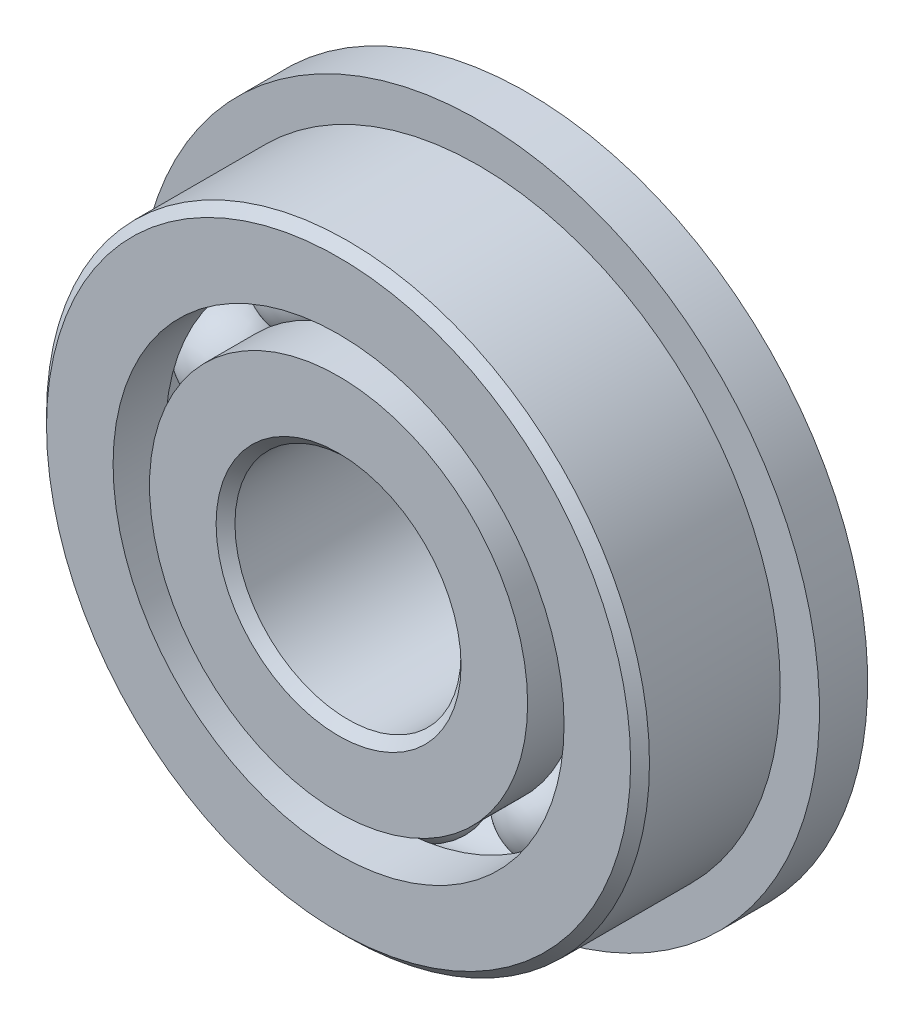
ISO-10303-21;
HEADER;
FILE_DESCRIPTION(('STEP AP214'),'2;1');
FILE_NAME('part.step','',(''),(''),'','','');
FILE_SCHEMA(('AUTOMOTIVE_DESIGN { 1 0 10303 214 1 1 1 1 }'));
ENDSEC;
DATA;
#1=APPLICATION_CONTEXT('core data for automotive mechanical design processes');
#2=APPLICATION_PROTOCOL_DEFINITION('international standard','automotive_design',2000,#1);
#3=PRODUCT_CONTEXT('',#1,'mechanical');
#4=PRODUCT('Part','Part','',(#3));
#5=PRODUCT_RELATED_PRODUCT_CATEGORY('part','',(#4));
#6=PRODUCT_DEFINITION_FORMATION('','',#4);
#7=PRODUCT_DEFINITION_CONTEXT('part definition',#1,'design');
#8=PRODUCT_DEFINITION('design','',#6,#7);
#9=PRODUCT_DEFINITION_SHAPE('','',#8);
#10=(LENGTH_UNIT() NAMED_UNIT(*) SI_UNIT(.MILLI.,.METRE.));
#11=(NAMED_UNIT(*) PLANE_ANGLE_UNIT() SI_UNIT($,.RADIAN.));
#12=(NAMED_UNIT(*) SI_UNIT($,.STERADIAN.) SOLID_ANGLE_UNIT());
#13=UNCERTAINTY_MEASURE_WITH_UNIT(LENGTH_MEASURE(1.E-05),#10,'distance_accuracy_value','');
#14=(GEOMETRIC_REPRESENTATION_CONTEXT(3) GLOBAL_UNCERTAINTY_ASSIGNED_CONTEXT((#13)) GLOBAL_UNIT_ASSIGNED_CONTEXT((#10,
#11,#12)) REPRESENTATION_CONTEXT('',''));
#15=CARTESIAN_POINT('',(0.,0.,0.));
#16=DIRECTION('',(0.,0.,1.));
#17=DIRECTION('',(1.,0.,0.));
#18=AXIS2_PLACEMENT_3D('',#15,#16,#17);
#19=CARTESIAN_POINT('',(-2.56604999203928,3.53186481606816,0.));
#20=DIRECTION('',(0.,0.,1.));
#21=DIRECTION('',(-0.587785252292462,0.809016994374955,0.));
#22=AXIS2_PLACEMENT_3D('',#19,#20,#21);
#23=SPHERICAL_SURFACE('',#22,0.961832467237323);
#24=CARTESIAN_POINT('',(-2.56604999203928,3.53186481606816,0.961832467237323));
#25=VERTEX_POINT('',#24);
#26=VERTEX_LOOP('',#25);
#27=FACE_BOUND('',#26,.T.);
#28=ADVANCED_FACE('F39',(#27),#23,.T.);
#29=CLOSED_SHELL('',(#28));
#30=MANIFOLD_SOLID_BREP('B2',#29);
#31=CARTESIAN_POINT('',(-4.15195610395101,1.34905231606818,0.));
#32=DIRECTION('',(0.,0.,1.));
#33=DIRECTION('',(-0.95105651629515,0.309016994374958,0.));
#34=AXIS2_PLACEMENT_3D('',#31,#32,#33);
#35=SPHERICAL_SURFACE('',#34,0.961832467237323);
#36=CARTESIAN_POINT('',(-4.15195610395101,1.34905231606818,0.961832467237323));
#37=VERTEX_POINT('',#36);
#38=VERTEX_LOOP('',#37);
#39=FACE_BOUND('',#38,.T.);
#40=ADVANCED_FACE('F59',(#39),#35,.T.);
#41=CLOSED_SHELL('',(#40));
#42=MANIFOLD_SOLID_BREP('B6',#41);
#43=CARTESIAN_POINT('',(-4.15195610395104,-1.34905231606809,0.));
#44=DIRECTION('',(0.,0.,1.));
#45=DIRECTION('',(-0.951056516295157,-0.309016994374938,0.));
#46=AXIS2_PLACEMENT_3D('',#43,#44,#45);
#47=SPHERICAL_SURFACE('',#46,0.961832467237323);
#48=CARTESIAN_POINT('',(-4.15195610395104,-1.34905231606809,0.961832467237323));
#49=VERTEX_POINT('',#48);
#50=VERTEX_LOOP('',#49);
#51=FACE_BOUND('',#50,.T.);
#52=ADVANCED_FACE('F79',(#51),#47,.T.);
#53=CLOSED_SHELL('',(#52));
#54=MANIFOLD_SOLID_BREP('B35',#53);
#55=CARTESIAN_POINT('',(-2.56604999203936,-3.53186481606811,0.));
#56=DIRECTION('',(0.,0.,1.));
#57=DIRECTION('',(-0.58778525229248,-0.809016994374942,0.));
#58=AXIS2_PLACEMENT_3D('',#55,#56,#57);
#59=SPHERICAL_SURFACE('',#58,0.961832467237323);
#60=CARTESIAN_POINT('',(-2.56604999203936,-3.53186481606811,0.961832467237323));
#61=VERTEX_POINT('',#60);
#62=VERTEX_LOOP('',#61);
#63=FACE_BOUND('',#62,.T.);
#64=ADVANCED_FACE('F99',(#63),#59,.T.);
#65=CLOSED_SHELL('',(#64));
#66=MANIFOLD_SOLID_BREP('B55',#65);
#67=CARTESIAN_POINT('',(0.,-4.365625,0.));
#68=DIRECTION('',(0.,0.,1.));
#69=DIRECTION('',(0.,-1.,0.));
#70=AXIS2_PLACEMENT_3D('',#67,#68,#69);
#71=SPHERICAL_SURFACE('',#70,0.961832467237323);
#72=CARTESIAN_POINT('',(0.,-4.365625,0.961832467237323));
#73=VERTEX_POINT('',#72);
#74=VERTEX_LOOP('',#73);
#75=FACE_BOUND('',#74,.T.);
#76=ADVANCED_FACE('F119',(#75),#71,.T.);
#77=CLOSED_SHELL('',(#76));
#78=MANIFOLD_SOLID_BREP('B75',#77);
#79=CARTESIAN_POINT('',(2.56604999203931,-3.53186481606814,0.));
#80=DIRECTION('',(0.,0.,1.));
#81=DIRECTION('',(0.587785252292469,-0.809016994374951,0.));
#82=AXIS2_PLACEMENT_3D('',#79,#80,#81);
#83=SPHERICAL_SURFACE('',#82,0.961832467237323);
#84=CARTESIAN_POINT('',(2.56604999203931,-3.53186481606814,0.961832467237323));
#85=VERTEX_POINT('',#84);
#86=VERTEX_LOOP('',#85);
#87=FACE_BOUND('',#86,.T.);
#88=ADVANCED_FACE('F139',(#87),#83,.T.);
#89=CLOSED_SHELL('',(#88));
#90=MANIFOLD_SOLID_BREP('B95',#89);
#91=CARTESIAN_POINT('',(4.15195610395102,-1.34905231606815,0.));
#92=DIRECTION('',(0.,0.,1.));
#93=DIRECTION('',(0.951056516295152,-0.309016994374952,0.));
#94=AXIS2_PLACEMENT_3D('',#91,#92,#93);
#95=SPHERICAL_SURFACE('',#94,0.961832467237323);
#96=CARTESIAN_POINT('',(4.15195610395102,-1.34905231606815,0.961832467237323));
#97=VERTEX_POINT('',#96);
#98=VERTEX_LOOP('',#97);
#99=FACE_BOUND('',#98,.T.);
#100=ADVANCED_FACE('F159',(#99),#95,.T.);
#101=CLOSED_SHELL('',(#100));
#102=MANIFOLD_SOLID_BREP('B115',#101);
#103=CARTESIAN_POINT('',(4.15195610395103,1.34905231606812,0.));
#104=DIRECTION('',(0.,0.,1.));
#105=DIRECTION('',(0.951056516295155,0.309016994374945,0.));
#106=AXIS2_PLACEMENT_3D('',#103,#104,#105);
#107=SPHERICAL_SURFACE('',#106,0.961832467237323);
#108=CARTESIAN_POINT('',(4.15195610395103,1.34905231606812,0.961832467237323));
#109=VERTEX_POINT('',#108);
#110=VERTEX_LOOP('',#109);
#111=FACE_BOUND('',#110,.T.);
#112=ADVANCED_FACE('F179',(#111),#107,.T.);
#113=CLOSED_SHELL('',(#112));
#114=MANIFOLD_SOLID_BREP('B135',#113);
#115=CARTESIAN_POINT('',(2.56604999203933,3.53186481606813,0.));
#116=DIRECTION('',(0.,0.,1.));
#117=DIRECTION('',(0.587785252292474,0.809016994374947,0.));
#118=AXIS2_PLACEMENT_3D('',#115,#116,#117);
#119=SPHERICAL_SURFACE('',#118,0.961832467237323);
#120=CARTESIAN_POINT('',(2.56604999203933,3.53186481606813,0.961832467237323));
#121=VERTEX_POINT('',#120);
#122=VERTEX_LOOP('',#121);
#123=FACE_BOUND('',#122,.T.);
#124=ADVANCED_FACE('F199',(#123),#119,.T.);
#125=CLOSED_SHELL('',(#124));
#126=MANIFOLD_SOLID_BREP('B155',#125);
#127=CARTESIAN_POINT('',(0.,4.365625,0.));
#128=DIRECTION('',(0.,0.,1.));
#129=DIRECTION('',(0.,1.,0.));
#130=AXIS2_PLACEMENT_3D('',#127,#128,#129);
#131=SPHERICAL_SURFACE('',#130,0.961832467237323);
#132=CARTESIAN_POINT('',(0.,4.365625,0.961832467237323));
#133=VERTEX_POINT('',#132);
#134=VERTEX_LOOP('',#133);
#135=FACE_BOUND('',#134,.T.);
#136=ADVANCED_FACE('F221',(#135),#131,.T.);
#137=CLOSED_SHELL('',(#136));
#138=MANIFOLD_SOLID_BREP('B175',#137);
#139=CARTESIAN_POINT('',(0.,3.98183379120879,1.984375));
#140=DIRECTION('',(0.,0.,-1.));
#141=DIRECTION('',(-1.,0.,0.));
#142=AXIS2_PLACEMENT_3D('',#139,#140,#141);
#143=PLANE('',#142);
#144=CARTESIAN_POINT('',(0.,0.,1.984375));
#145=DIRECTION('',(0.,0.,1.));
#146=DIRECTION('',(1.,0.,0.));
#147=AXIS2_PLACEMENT_3D('',#144,#145,#146);
#148=CIRCLE('',#147,2.5796875);
#149=CARTESIAN_POINT('',(2.5796875,0.,1.984375));
#150=VERTEX_POINT('',#149);
#151=EDGE_CURVE('E268',#150,#150,#148,.T.);
#152=ORIENTED_EDGE('',*,*,#151,.F.);
#153=EDGE_LOOP('',(#152));
#154=FACE_BOUND('',#153,.T.);
#155=CARTESIAN_POINT('',(0.,0.,1.984375));
#156=DIRECTION('',(0.,0.,1.));
#157=DIRECTION('',(1.,0.,0.));
#158=AXIS2_PLACEMENT_3D('',#155,#156,#157);
#159=CIRCLE('',#158,3.98183379120879);
#160=CARTESIAN_POINT('',(3.98183379120879,0.,1.984375));
#161=VERTEX_POINT('',#160);
#162=EDGE_CURVE('E220',#161,#161,#159,.T.);
#163=ORIENTED_EDGE('',*,*,#162,.T.);
#164=EDGE_LOOP('',(#163));
#165=FACE_BOUND('',#164,.T.);
#166=ADVANCED_FACE('F240',(#154,#165),#143,.F.);
#167=CARTESIAN_POINT('',(0.,0.,1.984375));
#168=DIRECTION('',(0.,0.,1.));
#169=DIRECTION('',(1.,0.,0.));
#170=AXIS2_PLACEMENT_3D('',#167,#168,#169);
#171=CYLINDRICAL_SURFACE('',#170,3.98183379120879);
#172=ORIENTED_EDGE('',*,*,#162,.F.);
#173=EDGE_LOOP('',(#172));
#174=FACE_BOUND('',#173,.T.);
#175=CARTESIAN_POINT('',(0.,0.,0.881944444444444));
#176=DIRECTION('',(0.,0.,1.));
#177=DIRECTION('',(1.,0.,0.));
#178=AXIS2_PLACEMENT_3D('',#175,#176,#177);
#179=CIRCLE('',#178,3.98183379120879);
#180=CARTESIAN_POINT('',(3.98183379120879,0.,0.881944444444444));
#181=VERTEX_POINT('',#180);
#182=EDGE_CURVE('E246',#181,#181,#179,.T.);
#183=ORIENTED_EDGE('',*,*,#182,.T.);
#184=EDGE_LOOP('',(#183));
#185=FACE_BOUND('',#184,.T.);
#186=ADVANCED_FACE('F275',(#174,#185),#171,.T.);
#187=CARTESIAN_POINT('',(0.,0.,0.));
#188=DIRECTION('',(0.,0.,1.));
#189=DIRECTION('',(1.,0.,0.));
#190=AXIS2_PLACEMENT_3D('',#187,#188,#189);
#191=TOROIDAL_SURFACE('',#190,4.365625,0.961832467237322);
#192=ORIENTED_EDGE('',*,*,#182,.F.);
#193=EDGE_LOOP('',(#192));
#194=FACE_BOUND('',#193,.T.);
#195=CARTESIAN_POINT('',(0.,0.,-0.881944444444445));
#196=DIRECTION('',(0.,0.,1.));
#197=DIRECTION('',(1.,0.,0.));
#198=AXIS2_PLACEMENT_3D('',#195,#196,#197);
#199=CIRCLE('',#198,3.98183379120879);
#200=CARTESIAN_POINT('',(3.98183379120879,0.,-0.881944444444445));
#201=VERTEX_POINT('',#200);
#202=EDGE_CURVE('E250',#201,#201,#199,.T.);
#203=ORIENTED_EDGE('',*,*,#202,.T.);
#204=EDGE_LOOP('',(#203));
#205=FACE_BOUND('',#204,.T.);
#206=ADVANCED_FACE('F279',(#194,#205),#191,.F.);
#207=CARTESIAN_POINT('',(0.,0.,1.984375));
#208=DIRECTION('',(0.,0.,1.));
#209=DIRECTION('',(1.,0.,0.));
#210=AXIS2_PLACEMENT_3D('',#207,#208,#209);
#211=CYLINDRICAL_SURFACE('',#210,3.98183379120879);
#212=ORIENTED_EDGE('',*,*,#202,.F.);
#213=EDGE_LOOP('',(#212));
#214=FACE_BOUND('',#213,.T.);
#215=CARTESIAN_POINT('',(0.,0.,-1.984375));
#216=DIRECTION('',(0.,0.,1.));
#217=DIRECTION('',(1.,0.,0.));
#218=AXIS2_PLACEMENT_3D('',#215,#216,#217);
#219=CIRCLE('',#218,3.98183379120879);
#220=CARTESIAN_POINT('',(3.98183379120879,0.,-1.984375));
#221=VERTEX_POINT('',#220);
#222=EDGE_CURVE('E254',#221,#221,#219,.T.);
#223=ORIENTED_EDGE('',*,*,#222,.T.);
#224=EDGE_LOOP('',(#223));
#225=FACE_BOUND('',#224,.T.);
#226=ADVANCED_FACE('F284',(#214,#225),#211,.T.);
#227=CARTESIAN_POINT('',(0.,2.5796875,-1.984375));
#228=DIRECTION('',(0.,0.,1.));
#229=DIRECTION('',(1.,0.,0.));
#230=AXIS2_PLACEMENT_3D('',#227,#228,#229);
#231=PLANE('',#230);
#232=ORIENTED_EDGE('',*,*,#222,.F.);
#233=EDGE_LOOP('',(#232));
#234=FACE_BOUND('',#233,.T.);
#235=CARTESIAN_POINT('',(0.,0.,-1.984375));
#236=DIRECTION('',(0.,0.,1.));
#237=DIRECTION('',(1.,0.,0.));
#238=AXIS2_PLACEMENT_3D('',#235,#236,#237);
#239=CIRCLE('',#238,2.5796875);
#240=CARTESIAN_POINT('',(2.5796875,0.,-1.984375));
#241=VERTEX_POINT('',#240);
#242=EDGE_CURVE('E259',#241,#241,#239,.T.);
#243=ORIENTED_EDGE('',*,*,#242,.T.);
#244=EDGE_LOOP('',(#243));
#245=FACE_BOUND('',#244,.T.);
#246=ADVANCED_FACE('F290',(#234,#245),#231,.F.);
#247=CARTESIAN_POINT('',(0.,0.,-1.7859375));
#248=DIRECTION('',(0.,0.,-1.));
#249=DIRECTION('',(-1.,0.,0.));
#250=AXIS2_PLACEMENT_3D('',#247,#248,#249);
#251=CONICAL_SURFACE('',#250,2.38125,0.785398163397447);
#252=ORIENTED_EDGE('',*,*,#242,.F.);
#253=EDGE_LOOP('',(#252));
#254=FACE_BOUND('',#253,.T.);
#255=CARTESIAN_POINT('',(0.,0.,-1.7859375));
#256=DIRECTION('',(0.,0.,1.));
#257=DIRECTION('',(1.,0.,0.));
#258=AXIS2_PLACEMENT_3D('',#255,#256,#257);
#259=CIRCLE('',#258,2.38125);
#260=CARTESIAN_POINT('',(2.38125,0.,-1.7859375));
#261=VERTEX_POINT('',#260);
#262=EDGE_CURVE('E262',#261,#261,#259,.T.);
#263=ORIENTED_EDGE('',*,*,#262,.T.);
#264=EDGE_LOOP('',(#263));
#265=FACE_BOUND('',#264,.T.);
#266=ADVANCED_FACE('F294',(#254,#265),#251,.F.);
#267=CARTESIAN_POINT('',(0.,0.,1.984375));
#268=DIRECTION('',(0.,0.,1.));
#269=DIRECTION('',(1.,0.,0.));
#270=AXIS2_PLACEMENT_3D('',#267,#268,#269);
#271=CYLINDRICAL_SURFACE('',#270,2.38125);
#272=ORIENTED_EDGE('',*,*,#262,.F.);
#273=EDGE_LOOP('',(#272));
#274=FACE_BOUND('',#273,.T.);
#275=CARTESIAN_POINT('',(0.,0.,1.7859375));
#276=DIRECTION('',(0.,0.,1.));
#277=DIRECTION('',(1.,0.,0.));
#278=AXIS2_PLACEMENT_3D('',#275,#276,#277);
#279=CIRCLE('',#278,2.38125);
#280=CARTESIAN_POINT('',(2.38125,0.,1.7859375));
#281=VERTEX_POINT('',#280);
#282=EDGE_CURVE('E265',#281,#281,#279,.T.);
#283=ORIENTED_EDGE('',*,*,#282,.T.);
#284=EDGE_LOOP('',(#283));
#285=FACE_BOUND('',#284,.T.);
#286=ADVANCED_FACE('F298',(#274,#285),#271,.F.);
#287=CARTESIAN_POINT('',(0.,0.,1.984375));
#288=DIRECTION('',(0.,0.,1.));
#289=DIRECTION('',(1.,0.,0.));
#290=AXIS2_PLACEMENT_3D('',#287,#288,#289);
#291=CONICAL_SURFACE('',#290,2.5796875,0.78539816339745);
#292=ORIENTED_EDGE('',*,*,#282,.F.);
#293=EDGE_LOOP('',(#292));
#294=FACE_BOUND('',#293,.T.);
#295=ORIENTED_EDGE('',*,*,#151,.T.);
#296=EDGE_LOOP('',(#295));
#297=FACE_BOUND('',#296,.T.);
#298=ADVANCED_FACE('F272',(#294,#297),#291,.F.);
#299=CLOSED_SHELL('',(#166,#186,#206,#226,#246,#266,#286,#298));
#300=MANIFOLD_SOLID_BREP('B195',#299);
#301=CARTESIAN_POINT('',(0.,0.,1.7859375));
#302=DIRECTION('',(0.,0.,-1.));
#303=DIRECTION('',(-1.,0.,0.));
#304=AXIS2_PLACEMENT_3D('',#301,#302,#303);
#305=CONICAL_SURFACE('',#304,6.35,0.785398163397445);
#306=CARTESIAN_POINT('',(0.,0.,1.984375));
#307=DIRECTION('',(0.,0.,1.));
#308=DIRECTION('',(1.,0.,0.));
#309=AXIS2_PLACEMENT_3D('',#306,#307,#308);
#310=CIRCLE('',#309,6.1515625);
#311=CARTESIAN_POINT('',(6.1515625,0.,1.984375));
#312=VERTEX_POINT('',#311);
#313=EDGE_CURVE('E383',#312,#312,#310,.T.);
#314=ORIENTED_EDGE('',*,*,#313,.F.);
#315=EDGE_LOOP('',(#314));
#316=FACE_BOUND('',#315,.T.);
#317=CARTESIAN_POINT('',(0.,0.,1.7859375));
#318=DIRECTION('',(0.,0.,1.));
#319=DIRECTION('',(1.,0.,0.));
#320=AXIS2_PLACEMENT_3D('',#317,#318,#319);
#321=CIRCLE('',#320,6.35);
#322=CARTESIAN_POINT('',(6.35,0.,1.7859375));
#323=VERTEX_POINT('',#322);
#324=EDGE_CURVE('E239',#323,#323,#321,.T.);
#325=ORIENTED_EDGE('',*,*,#324,.T.);
#326=EDGE_LOOP('',(#325));
#327=FACE_BOUND('',#326,.T.);
#328=ADVANCED_FACE('F361',(#316,#327),#305,.T.);
#329=CARTESIAN_POINT('',(0.,0.,1.984375));
#330=DIRECTION('',(0.,0.,1.));
#331=DIRECTION('',(1.,0.,0.));
#332=AXIS2_PLACEMENT_3D('',#329,#330,#331);
#333=CYLINDRICAL_SURFACE('',#332,6.35);
#334=CARTESIAN_POINT('',(0.,0.,-0.968375));
#335=DIRECTION('',(0.,0.,1.));
#336=DIRECTION('',(1.,0.,0.));
#337=AXIS2_PLACEMENT_3D('',#334,#335,#336);
#338=CIRCLE('',#337,6.35);
#339=CARTESIAN_POINT('',(6.35,0.,-0.968375));
#340=VERTEX_POINT('',#339);
#341=EDGE_CURVE('E386',#340,#340,#338,.T.);
#342=ORIENTED_EDGE('',*,*,#341,.T.);
#343=EDGE_LOOP('',(#342));
#344=FACE_BOUND('',#343,.T.);
#345=ORIENTED_EDGE('',*,*,#324,.F.);
#346=EDGE_LOOP('',(#345));
#347=FACE_BOUND('',#346,.T.);
#348=ADVANCED_FACE('F406',(#344,#347),#333,.T.);
#349=CARTESIAN_POINT('',(0.,6.1515625,-1.984375));
#350=DIRECTION('',(0.,0.,1.));
#351=DIRECTION('',(1.,0.,0.));
#352=AXIS2_PLACEMENT_3D('',#349,#350,#351);
#353=PLANE('',#352);
#354=CARTESIAN_POINT('',(0.,0.,-1.984375));
#355=DIRECTION('',(0.,0.,1.));
#356=DIRECTION('',(1.,0.,0.));
#357=AXIS2_PLACEMENT_3D('',#354,#355,#356);
#358=CIRCLE('',#357,4.74941620879121);
#359=CARTESIAN_POINT('',(4.74941620879121,0.,-1.984375));
#360=VERTEX_POINT('',#359);
#361=EDGE_CURVE('E367',#360,#360,#358,.T.);
#362=ORIENTED_EDGE('',*,*,#361,.T.);
#363=EDGE_LOOP('',(#362));
#364=FACE_BOUND('',#363,.T.);
#365=CARTESIAN_POINT('',(0.,0.,-1.984375));
#366=DIRECTION('',(0.,0.,-1.));
#367=DIRECTION('',(-1.,0.,0.));
#368=AXIS2_PLACEMENT_3D('',#365,#366,#367);
#369=CIRCLE('',#368,7.1755);
#370=CARTESIAN_POINT('',(-7.1755,0.,-1.984375));
#371=VERTEX_POINT('',#370);
#372=EDGE_CURVE('E389',#371,#371,#369,.T.);
#373=ORIENTED_EDGE('',*,*,#372,.T.);
#374=EDGE_LOOP('',(#373));
#375=FACE_BOUND('',#374,.T.);
#376=ADVANCED_FACE('F409',(#364,#375),#353,.F.);
#377=CARTESIAN_POINT('',(0.,0.,1.984375));
#378=DIRECTION('',(0.,0.,1.));
#379=DIRECTION('',(1.,0.,0.));
#380=AXIS2_PLACEMENT_3D('',#377,#378,#379);
#381=CYLINDRICAL_SURFACE('',#380,4.74941620879121);
#382=CARTESIAN_POINT('',(0.,0.,-0.881944444444445));
#383=DIRECTION('',(0.,0.,1.));
#384=DIRECTION('',(1.,0.,0.));
#385=AXIS2_PLACEMENT_3D('',#382,#383,#384);
#386=CIRCLE('',#385,4.74941620879121);
#387=CARTESIAN_POINT('',(4.74941620879121,0.,-0.881944444444445));
#388=VERTEX_POINT('',#387);
#389=EDGE_CURVE('E371',#388,#388,#386,.T.);
#390=ORIENTED_EDGE('',*,*,#389,.T.);
#391=EDGE_LOOP('',(#390));
#392=FACE_BOUND('',#391,.T.);
#393=ORIENTED_EDGE('',*,*,#361,.F.);
#394=EDGE_LOOP('',(#393));
#395=FACE_BOUND('',#394,.T.);
#396=ADVANCED_FACE('F414',(#392,#395),#381,.F.);
#397=CARTESIAN_POINT('',(0.,0.,0.));
#398=DIRECTION('',(0.,0.,1.));
#399=DIRECTION('',(1.,0.,0.));
#400=AXIS2_PLACEMENT_3D('',#397,#398,#399);
#401=TOROIDAL_SURFACE('',#400,4.365625,0.961832467237323);
#402=ORIENTED_EDGE('',*,*,#389,.F.);
#403=EDGE_LOOP('',(#402));
#404=FACE_BOUND('',#403,.T.);
#405=CARTESIAN_POINT('',(0.,0.,0.881944444444444));
#406=DIRECTION('',(0.,0.,1.));
#407=DIRECTION('',(1.,0.,0.));
#408=AXIS2_PLACEMENT_3D('',#405,#406,#407);
#409=CIRCLE('',#408,4.74941620879121);
#410=CARTESIAN_POINT('',(4.74941620879121,0.,0.881944444444444));
#411=VERTEX_POINT('',#410);
#412=EDGE_CURVE('E375',#411,#411,#409,.T.);
#413=ORIENTED_EDGE('',*,*,#412,.T.);
#414=EDGE_LOOP('',(#413));
#415=FACE_BOUND('',#414,.T.);
#416=ADVANCED_FACE('F420',(#404,#415),#401,.F.);
#417=CARTESIAN_POINT('',(0.,0.,1.984375));
#418=DIRECTION('',(0.,0.,1.));
#419=DIRECTION('',(1.,0.,0.));
#420=AXIS2_PLACEMENT_3D('',#417,#418,#419);
#421=CYLINDRICAL_SURFACE('',#420,4.74941620879121);
#422=ORIENTED_EDGE('',*,*,#412,.F.);
#423=EDGE_LOOP('',(#422));
#424=FACE_BOUND('',#423,.T.);
#425=CARTESIAN_POINT('',(0.,0.,1.984375));
#426=DIRECTION('',(0.,0.,1.));
#427=DIRECTION('',(1.,0.,0.));
#428=AXIS2_PLACEMENT_3D('',#425,#426,#427);
#429=CIRCLE('',#428,4.74941620879121);
#430=CARTESIAN_POINT('',(4.74941620879121,0.,1.984375));
#431=VERTEX_POINT('',#430);
#432=EDGE_CURVE('E380',#431,#431,#429,.T.);
#433=ORIENTED_EDGE('',*,*,#432,.T.);
#434=EDGE_LOOP('',(#433));
#435=FACE_BOUND('',#434,.T.);
#436=ADVANCED_FACE('F424',(#424,#435),#421,.F.);
#437=CARTESIAN_POINT('',(0.,6.1515625,1.984375));
#438=DIRECTION('',(0.,0.,-1.));
#439=DIRECTION('',(-1.,0.,0.));
#440=AXIS2_PLACEMENT_3D('',#437,#438,#439);
#441=PLANE('',#440);
#442=ORIENTED_EDGE('',*,*,#432,.F.);
#443=EDGE_LOOP('',(#442));
#444=FACE_BOUND('',#443,.T.);
#445=ORIENTED_EDGE('',*,*,#313,.T.);
#446=EDGE_LOOP('',(#445));
#447=FACE_BOUND('',#446,.T.);
#448=ADVANCED_FACE('F402',(#444,#447),#441,.F.);
#449=CARTESIAN_POINT('',(0.,4.74941620879121,-0.968375));
#450=DIRECTION('',(0.,0.,1.));
#451=DIRECTION('',(1.,0.,0.));
#452=AXIS2_PLACEMENT_3D('',#449,#450,#451);
#453=PLANE('',#452);
#454=CARTESIAN_POINT('',(0.,0.,-0.968375));
#455=DIRECTION('',(0.,0.,-1.));
#456=DIRECTION('',(-1.,0.,0.));
#457=AXIS2_PLACEMENT_3D('',#454,#455,#456);
#458=CIRCLE('',#457,7.1755);
#459=CARTESIAN_POINT('',(-7.1755,0.,-0.968375));
#460=VERTEX_POINT('',#459);
#461=EDGE_CURVE('E392',#460,#460,#458,.T.);
#462=ORIENTED_EDGE('',*,*,#461,.F.);
#463=EDGE_LOOP('',(#462));
#464=FACE_BOUND('',#463,.T.);
#465=ORIENTED_EDGE('',*,*,#341,.F.);
#466=EDGE_LOOP('',(#465));
#467=FACE_BOUND('',#466,.T.);
#468=ADVANCED_FACE('F399',(#464,#467),#453,.T.);
#469=CARTESIAN_POINT('',(0.,0.,-1.984375));
#470=DIRECTION('',(0.,0.,-1.));
#471=DIRECTION('',(-1.,0.,0.));
#472=AXIS2_PLACEMENT_3D('',#469,#470,#471);
#473=CYLINDRICAL_SURFACE('',#472,7.1755);
#474=ORIENTED_EDGE('',*,*,#461,.T.);
#475=EDGE_LOOP('',(#474));
#476=FACE_BOUND('',#475,.T.);
#477=ORIENTED_EDGE('',*,*,#372,.F.);
#478=EDGE_LOOP('',(#477));
#479=FACE_BOUND('',#478,.T.);
#480=ADVANCED_FACE('F396',(#476,#479),#473,.T.);
#481=CLOSED_SHELL('',(#328,#348,#376,#396,#416,#436,#448,#468,#480));
#482=MANIFOLD_SOLID_BREP('B215',#481);
#483=ADVANCED_BREP_SHAPE_REPRESENTATION('',(#18,#30,#42,#54,#66,#78,#90,#102,#114,#126,#138,
#300,#482),#14);
#484=SHAPE_DEFINITION_REPRESENTATION(#9,#483);
ENDSEC;
END-ISO-10303-21;
